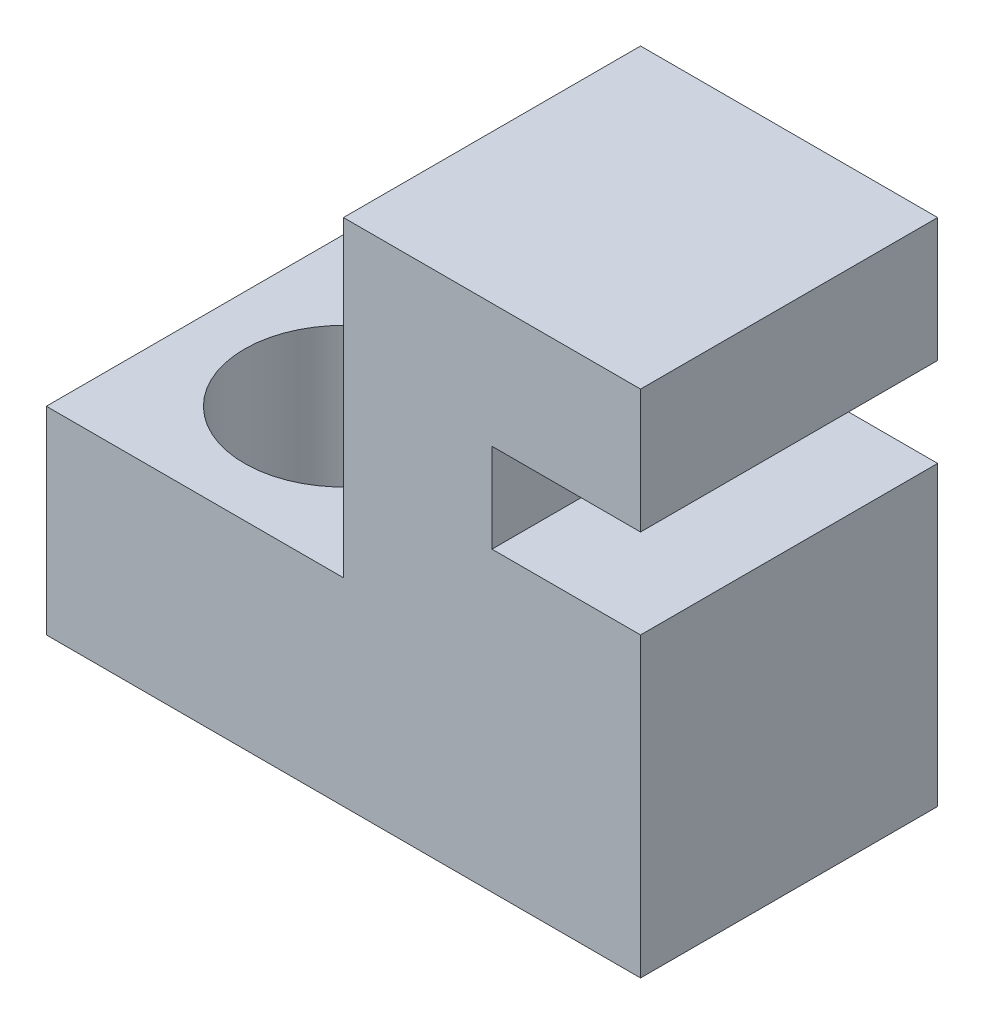
ISO-10303-21;
HEADER;
FILE_DESCRIPTION(('STEP AP214'),'2;1');
FILE_NAME('part.step','',(''),(''),'','','');
FILE_SCHEMA(('AUTOMOTIVE_DESIGN { 1 0 10303 214 1 1 1 1 }'));
ENDSEC;
DATA;
#1=APPLICATION_CONTEXT('core data for automotive mechanical design processes');
#2=APPLICATION_PROTOCOL_DEFINITION('international standard','automotive_design',2000,#1);
#3=PRODUCT_CONTEXT('',#1,'mechanical');
#4=PRODUCT('Part','Part','',(#3));
#5=PRODUCT_RELATED_PRODUCT_CATEGORY('part','',(#4));
#6=PRODUCT_DEFINITION_FORMATION('','',#4);
#7=PRODUCT_DEFINITION_CONTEXT('part definition',#1,'design');
#8=PRODUCT_DEFINITION('design','',#6,#7);
#9=PRODUCT_DEFINITION_SHAPE('','',#8);
#10=(LENGTH_UNIT() NAMED_UNIT(*) SI_UNIT(.MILLI.,.METRE.));
#11=(NAMED_UNIT(*) PLANE_ANGLE_UNIT() SI_UNIT($,.RADIAN.));
#12=(NAMED_UNIT(*) SI_UNIT($,.STERADIAN.) SOLID_ANGLE_UNIT());
#13=UNCERTAINTY_MEASURE_WITH_UNIT(LENGTH_MEASURE(1.E-05),#10,'distance_accuracy_value','');
#14=(GEOMETRIC_REPRESENTATION_CONTEXT(3) GLOBAL_UNCERTAINTY_ASSIGNED_CONTEXT((#13)) GLOBAL_UNIT_ASSIGNED_CONTEXT((#10,
#11,#12)) REPRESENTATION_CONTEXT('',''));
#15=CARTESIAN_POINT('',(0.,0.,0.));
#16=DIRECTION('',(0.,0.,1.));
#17=DIRECTION('',(1.,0.,0.));
#18=AXIS2_PLACEMENT_3D('',#15,#16,#17);
#19=CARTESIAN_POINT('',(12.,0.,6.));
#20=DIRECTION('',(0.,1.,0.));
#21=DIRECTION('',(-1.,0.,0.));
#22=AXIS2_PLACEMENT_3D('',#19,#20,#21);
#23=PLANE('',#22);
#24=CARTESIAN_POINT('',(3.,0.,3.));
#25=DIRECTION('',(0.,1.,0.));
#26=DIRECTION('',(-1.,0.,0.));
#27=AXIS2_PLACEMENT_3D('',#24,#25,#26);
#28=CIRCLE('',#27,2.);
#29=CARTESIAN_POINT('',(0.999999999999999,0.,3.));
#30=VERTEX_POINT('',#29);
#31=EDGE_CURVE('E147',#30,#30,#28,.T.);
#32=ORIENTED_EDGE('',*,*,#31,.T.);
#33=EDGE_LOOP('',(#32));
#34=FACE_BOUND('',#33,.T.);
#35=DIRECTION('',(1.,0.,0.));
#36=VECTOR('',#35,1.);
#37=CARTESIAN_POINT('',(12.,0.,0.));
#38=LINE('',#37,#36);
#39=CARTESIAN_POINT('',(0.,0.,0.));
#40=VERTEX_POINT('',#39);
#41=CARTESIAN_POINT('',(12.,0.,0.));
#42=VERTEX_POINT('',#41);
#43=EDGE_CURVE('E143',#40,#42,#38,.T.);
#44=ORIENTED_EDGE('',*,*,#43,.T.);
#45=DIRECTION('',(0.,0.,-1.));
#46=VECTOR('',#45,1.);
#47=CARTESIAN_POINT('',(12.,0.,6.));
#48=LINE('',#47,#46);
#49=CARTESIAN_POINT('',(12.,0.,6.));
#50=VERTEX_POINT('',#49);
#51=EDGE_CURVE('E11',#50,#42,#48,.T.);
#52=ORIENTED_EDGE('',*,*,#51,.F.);
#53=DIRECTION('',(1.,0.,0.));
#54=VECTOR('',#53,1.);
#55=CARTESIAN_POINT('',(12.,0.,6.));
#56=LINE('',#55,#54);
#57=CARTESIAN_POINT('',(0.,0.,6.));
#58=VERTEX_POINT('',#57);
#59=EDGE_CURVE('E162',#58,#50,#56,.T.);
#60=ORIENTED_EDGE('',*,*,#59,.F.);
#61=DIRECTION('',(0.,0.,-1.));
#62=VECTOR('',#61,1.);
#63=CARTESIAN_POINT('',(0.,0.,6.));
#64=LINE('',#63,#62);
#65=EDGE_CURVE('E139',#58,#40,#64,.T.);
#66=ORIENTED_EDGE('',*,*,#65,.T.);
#67=EDGE_LOOP('',(#44,#52,#60,#66));
#68=FACE_BOUND('',#67,.T.);
#69=ADVANCED_FACE('F35',(#34,#68),#23,.F.);
#70=CARTESIAN_POINT('',(12.,6.,6.));
#71=DIRECTION('',(-1.,0.,0.));
#72=DIRECTION('',(0.,0.,1.));
#73=AXIS2_PLACEMENT_3D('',#70,#71,#72);
#74=PLANE('',#73);
#75=DIRECTION('',(0.,1.,0.));
#76=VECTOR('',#75,1.);
#77=CARTESIAN_POINT('',(12.,6.,0.));
#78=LINE('',#77,#76);
#79=CARTESIAN_POINT('',(12.,6.,0.));
#80=VERTEX_POINT('',#79);
#81=EDGE_CURVE('E146',#42,#80,#78,.T.);
#82=ORIENTED_EDGE('',*,*,#81,.T.);
#83=DIRECTION('',(0.,0.,-1.));
#84=VECTOR('',#83,1.);
#85=CARTESIAN_POINT('',(12.,6.,6.));
#86=LINE('',#85,#84);
#87=CARTESIAN_POINT('',(12.,6.,6.));
#88=VERTEX_POINT('',#87);
#89=EDGE_CURVE('E43',#88,#80,#86,.T.);
#90=ORIENTED_EDGE('',*,*,#89,.F.);
#91=DIRECTION('',(0.,1.,0.));
#92=VECTOR('',#91,1.);
#93=CARTESIAN_POINT('',(12.,6.,6.));
#94=LINE('',#93,#92);
#95=EDGE_CURVE('E100',#50,#88,#94,.T.);
#96=ORIENTED_EDGE('',*,*,#95,.F.);
#97=ORIENTED_EDGE('',*,*,#51,.T.);
#98=EDGE_LOOP('',(#82,#90,#96,#97));
#99=FACE_BOUND('',#98,.T.);
#100=ADVANCED_FACE('F234',(#99),#74,.F.);
#101=CARTESIAN_POINT('',(9.,6.,6.));
#102=DIRECTION('',(0.,-1.,0.));
#103=DIRECTION('',(1.,0.,0.));
#104=AXIS2_PLACEMENT_3D('',#101,#102,#103);
#105=PLANE('',#104);
#106=DIRECTION('',(-1.,0.,0.));
#107=VECTOR('',#106,1.);
#108=CARTESIAN_POINT('',(9.,6.,0.));
#109=LINE('',#108,#107);
#110=CARTESIAN_POINT('',(9.,6.,0.));
#111=VERTEX_POINT('',#110);
#112=EDGE_CURVE('E149',#80,#111,#109,.T.);
#113=ORIENTED_EDGE('',*,*,#112,.T.);
#114=DIRECTION('',(0.,0.,-1.));
#115=VECTOR('',#114,1.);
#116=CARTESIAN_POINT('',(9.,6.,6.));
#117=LINE('',#116,#115);
#118=CARTESIAN_POINT('',(9.,6.,6.));
#119=VERTEX_POINT('',#118);
#120=EDGE_CURVE('E175',#119,#111,#117,.T.);
#121=ORIENTED_EDGE('',*,*,#120,.F.);
#122=DIRECTION('',(-1.,0.,0.));
#123=VECTOR('',#122,1.);
#124=CARTESIAN_POINT('',(9.,6.,6.));
#125=LINE('',#124,#123);
#126=EDGE_CURVE('E183',#88,#119,#125,.T.);
#127=ORIENTED_EDGE('',*,*,#126,.F.);
#128=ORIENTED_EDGE('',*,*,#89,.T.);
#129=EDGE_LOOP('',(#113,#121,#127,#128));
#130=FACE_BOUND('',#129,.T.);
#131=ADVANCED_FACE('F181',(#130),#105,.F.);
#132=CARTESIAN_POINT('',(9.,7.8,6.));
#133=DIRECTION('',(-1.,0.,0.));
#134=DIRECTION('',(0.,-1.,0.));
#135=AXIS2_PLACEMENT_3D('',#132,#133,#134);
#136=PLANE('',#135);
#137=DIRECTION('',(0.,1.,0.));
#138=VECTOR('',#137,1.);
#139=CARTESIAN_POINT('',(9.,7.8,0.));
#140=LINE('',#139,#138);
#141=CARTESIAN_POINT('',(9.,7.8,0.));
#142=VERTEX_POINT('',#141);
#143=EDGE_CURVE('E151',#111,#142,#140,.T.);
#144=ORIENTED_EDGE('',*,*,#143,.T.);
#145=DIRECTION('',(0.,0.,-1.));
#146=VECTOR('',#145,1.);
#147=CARTESIAN_POINT('',(9.,7.8,6.));
#148=LINE('',#147,#146);
#149=CARTESIAN_POINT('',(9.,7.8,6.));
#150=VERTEX_POINT('',#149);
#151=EDGE_CURVE('E172',#150,#142,#148,.T.);
#152=ORIENTED_EDGE('',*,*,#151,.F.);
#153=DIRECTION('',(0.,1.,0.));
#154=VECTOR('',#153,1.);
#155=CARTESIAN_POINT('',(9.,7.8,6.));
#156=LINE('',#155,#154);
#157=EDGE_CURVE('E201',#119,#150,#156,.T.);
#158=ORIENTED_EDGE('',*,*,#157,.F.);
#159=ORIENTED_EDGE('',*,*,#120,.T.);
#160=EDGE_LOOP('',(#144,#152,#158,#159));
#161=FACE_BOUND('',#160,.T.);
#162=ADVANCED_FACE('F192',(#161),#136,.F.);
#163=CARTESIAN_POINT('',(12.,7.8,6.));
#164=DIRECTION('',(0.,1.,0.));
#165=DIRECTION('',(-1.,0.,0.));
#166=AXIS2_PLACEMENT_3D('',#163,#164,#165);
#167=PLANE('',#166);
#168=DIRECTION('',(1.,0.,0.));
#169=VECTOR('',#168,1.);
#170=CARTESIAN_POINT('',(12.,7.8,0.));
#171=LINE('',#170,#169);
#172=CARTESIAN_POINT('',(12.,7.8,0.));
#173=VERTEX_POINT('',#172);
#174=EDGE_CURVE('E153',#142,#173,#171,.T.);
#175=ORIENTED_EDGE('',*,*,#174,.T.);
#176=DIRECTION('',(0.,0.,-1.));
#177=VECTOR('',#176,1.);
#178=CARTESIAN_POINT('',(12.,7.8,6.));
#179=LINE('',#178,#177);
#180=CARTESIAN_POINT('',(12.,7.8,6.));
#181=VERTEX_POINT('',#180);
#182=EDGE_CURVE('E169',#181,#173,#179,.T.);
#183=ORIENTED_EDGE('',*,*,#182,.F.);
#184=DIRECTION('',(1.,0.,0.));
#185=VECTOR('',#184,1.);
#186=CARTESIAN_POINT('',(12.,7.8,6.));
#187=LINE('',#186,#185);
#188=EDGE_CURVE('E198',#150,#181,#187,.T.);
#189=ORIENTED_EDGE('',*,*,#188,.F.);
#190=ORIENTED_EDGE('',*,*,#151,.T.);
#191=EDGE_LOOP('',(#175,#183,#189,#190));
#192=FACE_BOUND('',#191,.T.);
#193=ADVANCED_FACE('F196',(#192),#167,.F.);
#194=CARTESIAN_POINT('',(12.,10.3,6.));
#195=DIRECTION('',(-1.,0.,0.));
#196=DIRECTION('',(0.,-1.,0.));
#197=AXIS2_PLACEMENT_3D('',#194,#195,#196);
#198=PLANE('',#197);
#199=DIRECTION('',(0.,1.,0.));
#200=VECTOR('',#199,1.);
#201=CARTESIAN_POINT('',(12.,10.3,0.));
#202=LINE('',#201,#200);
#203=CARTESIAN_POINT('',(12.,10.3,0.));
#204=VERTEX_POINT('',#203);
#205=EDGE_CURVE('E155',#173,#204,#202,.T.);
#206=ORIENTED_EDGE('',*,*,#205,.T.);
#207=DIRECTION('',(0.,0.,-1.));
#208=VECTOR('',#207,1.);
#209=CARTESIAN_POINT('',(12.,10.3,6.));
#210=LINE('',#209,#208);
#211=CARTESIAN_POINT('',(12.,10.3,6.));
#212=VERTEX_POINT('',#211);
#213=EDGE_CURVE('E166',#212,#204,#210,.T.);
#214=ORIENTED_EDGE('',*,*,#213,.F.);
#215=DIRECTION('',(0.,1.,0.));
#216=VECTOR('',#215,1.);
#217=CARTESIAN_POINT('',(12.,10.3,6.));
#218=LINE('',#217,#216);
#219=EDGE_CURVE('E200',#181,#212,#218,.T.);
#220=ORIENTED_EDGE('',*,*,#219,.F.);
#221=ORIENTED_EDGE('',*,*,#182,.T.);
#222=EDGE_LOOP('',(#206,#214,#220,#221));
#223=FACE_BOUND('',#222,.T.);
#224=ADVANCED_FACE('F247',(#223),#198,.F.);
#225=CARTESIAN_POINT('',(6.,10.3,6.));
#226=DIRECTION('',(0.,-1.,0.));
#227=DIRECTION('',(1.,0.,0.));
#228=AXIS2_PLACEMENT_3D('',#225,#226,#227);
#229=PLANE('',#228);
#230=DIRECTION('',(-1.,0.,0.));
#231=VECTOR('',#230,1.);
#232=CARTESIAN_POINT('',(6.,10.3,0.));
#233=LINE('',#232,#231);
#234=CARTESIAN_POINT('',(6.,10.3,0.));
#235=VERTEX_POINT('',#234);
#236=EDGE_CURVE('E157',#204,#235,#233,.T.);
#237=ORIENTED_EDGE('',*,*,#236,.T.);
#238=DIRECTION('',(0.,0.,-1.));
#239=VECTOR('',#238,1.);
#240=CARTESIAN_POINT('',(6.,10.3,6.));
#241=LINE('',#240,#239);
#242=CARTESIAN_POINT('',(6.,10.3,6.));
#243=VERTEX_POINT('',#242);
#244=EDGE_CURVE('E134',#243,#235,#241,.T.);
#245=ORIENTED_EDGE('',*,*,#244,.F.);
#246=DIRECTION('',(-1.,0.,0.));
#247=VECTOR('',#246,1.);
#248=CARTESIAN_POINT('',(6.,10.3,6.));
#249=LINE('',#248,#247);
#250=EDGE_CURVE('E125',#212,#243,#249,.T.);
#251=ORIENTED_EDGE('',*,*,#250,.F.);
#252=ORIENTED_EDGE('',*,*,#213,.T.);
#253=EDGE_LOOP('',(#237,#245,#251,#252));
#254=FACE_BOUND('',#253,.T.);
#255=ADVANCED_FACE('F231',(#254),#229,.F.);
#256=CARTESIAN_POINT('',(6.,4.,6.));
#257=DIRECTION('',(1.,0.,0.));
#258=DIRECTION('',(0.,1.,0.));
#259=AXIS2_PLACEMENT_3D('',#256,#257,#258);
#260=PLANE('',#259);
#261=DIRECTION('',(0.,-1.,0.));
#262=VECTOR('',#261,1.);
#263=CARTESIAN_POINT('',(6.,4.,0.));
#264=LINE('',#263,#262);
#265=CARTESIAN_POINT('',(6.,4.,0.));
#266=VERTEX_POINT('',#265);
#267=EDGE_CURVE('E133',#235,#266,#264,.T.);
#268=ORIENTED_EDGE('',*,*,#267,.T.);
#269=DIRECTION('',(0.,0.,-1.));
#270=VECTOR('',#269,1.);
#271=CARTESIAN_POINT('',(6.,4.,6.));
#272=LINE('',#271,#270);
#273=CARTESIAN_POINT('',(6.,4.,6.));
#274=VERTEX_POINT('',#273);
#275=EDGE_CURVE('E130',#274,#266,#272,.T.);
#276=ORIENTED_EDGE('',*,*,#275,.F.);
#277=DIRECTION('',(0.,-1.,0.));
#278=VECTOR('',#277,1.);
#279=CARTESIAN_POINT('',(6.,4.,6.));
#280=LINE('',#279,#278);
#281=EDGE_CURVE('E119',#243,#274,#280,.T.);
#282=ORIENTED_EDGE('',*,*,#281,.F.);
#283=ORIENTED_EDGE('',*,*,#244,.T.);
#284=EDGE_LOOP('',(#268,#276,#282,#283));
#285=FACE_BOUND('',#284,.T.);
#286=ADVANCED_FACE('F131',(#285),#260,.F.);
#287=CARTESIAN_POINT('',(0.,4.,6.));
#288=DIRECTION('',(0.,-1.,0.));
#289=DIRECTION('',(1.,0.,0.));
#290=AXIS2_PLACEMENT_3D('',#287,#288,#289);
#291=PLANE('',#290);
#292=CARTESIAN_POINT('',(3.,4.,3.));
#293=DIRECTION('',(0.,1.,0.));
#294=DIRECTION('',(-1.,0.,0.));
#295=AXIS2_PLACEMENT_3D('',#292,#293,#294);
#296=CIRCLE('',#295,2.);
#297=CARTESIAN_POINT('',(0.999999999999998,4.,3.));
#298=VERTEX_POINT('',#297);
#299=EDGE_CURVE('E209',#298,#298,#296,.T.);
#300=ORIENTED_EDGE('',*,*,#299,.F.);
#301=EDGE_LOOP('',(#300));
#302=FACE_BOUND('',#301,.T.);
#303=DIRECTION('',(-1.,0.,0.));
#304=VECTOR('',#303,1.);
#305=CARTESIAN_POINT('',(0.,4.,0.));
#306=LINE('',#305,#304);
#307=CARTESIAN_POINT('',(0.,4.,0.));
#308=VERTEX_POINT('',#307);
#309=EDGE_CURVE('E86',#266,#308,#306,.T.);
#310=ORIENTED_EDGE('',*,*,#309,.T.);
#311=DIRECTION('',(0.,0.,-1.));
#312=VECTOR('',#311,1.);
#313=CARTESIAN_POINT('',(0.,4.,6.));
#314=LINE('',#313,#312);
#315=CARTESIAN_POINT('',(0.,4.,6.));
#316=VERTEX_POINT('',#315);
#317=EDGE_CURVE('E135',#316,#308,#314,.T.);
#318=ORIENTED_EDGE('',*,*,#317,.F.);
#319=DIRECTION('',(-1.,0.,0.));
#320=VECTOR('',#319,1.);
#321=CARTESIAN_POINT('',(0.,4.,6.));
#322=LINE('',#321,#320);
#323=EDGE_CURVE('E123',#274,#316,#322,.T.);
#324=ORIENTED_EDGE('',*,*,#323,.F.);
#325=ORIENTED_EDGE('',*,*,#275,.T.);
#326=EDGE_LOOP('',(#310,#318,#324,#325));
#327=FACE_BOUND('',#326,.T.);
#328=ADVANCED_FACE('F137',(#302,#327),#291,.F.);
#329=CARTESIAN_POINT('',(0.,0.,6.));
#330=DIRECTION('',(1.,0.,0.));
#331=DIRECTION('',(0.,0.,-1.));
#332=AXIS2_PLACEMENT_3D('',#329,#330,#331);
#333=PLANE('',#332);
#334=DIRECTION('',(0.,-1.,0.));
#335=VECTOR('',#334,1.);
#336=CARTESIAN_POINT('',(0.,0.,0.));
#337=LINE('',#336,#335);
#338=EDGE_CURVE('E92',#308,#40,#337,.T.);
#339=ORIENTED_EDGE('',*,*,#338,.T.);
#340=ORIENTED_EDGE('',*,*,#65,.F.);
#341=DIRECTION('',(0.,-1.,0.));
#342=VECTOR('',#341,1.);
#343=CARTESIAN_POINT('',(0.,0.,6.));
#344=LINE('',#343,#342);
#345=EDGE_CURVE('E51',#316,#58,#344,.T.);
#346=ORIENTED_EDGE('',*,*,#345,.F.);
#347=ORIENTED_EDGE('',*,*,#317,.T.);
#348=EDGE_LOOP('',(#339,#340,#346,#347));
#349=FACE_BOUND('',#348,.T.);
#350=ADVANCED_FACE('F224',(#349),#333,.F.);
#351=CARTESIAN_POINT('',(0.,0.,6.));
#352=DIRECTION('',(0.,0.,-1.));
#353=DIRECTION('',(-1.,0.,0.));
#354=AXIS2_PLACEMENT_3D('',#351,#352,#353);
#355=PLANE('',#354);
#356=ORIENTED_EDGE('',*,*,#59,.T.);
#357=ORIENTED_EDGE('',*,*,#95,.T.);
#358=ORIENTED_EDGE('',*,*,#126,.T.);
#359=ORIENTED_EDGE('',*,*,#157,.T.);
#360=ORIENTED_EDGE('',*,*,#188,.T.);
#361=ORIENTED_EDGE('',*,*,#219,.T.);
#362=ORIENTED_EDGE('',*,*,#250,.T.);
#363=ORIENTED_EDGE('',*,*,#281,.T.);
#364=ORIENTED_EDGE('',*,*,#323,.T.);
#365=ORIENTED_EDGE('',*,*,#345,.T.);
#366=EDGE_LOOP('',(#356,#357,#358,#359,#360,#361,#362,#363,#364,#365));
#367=FACE_BOUND('',#366,.T.);
#368=ADVANCED_FACE('F121',(#367),#355,.F.);
#369=CARTESIAN_POINT('',(0.,0.,0.));
#370=DIRECTION('',(0.,0.,-1.));
#371=DIRECTION('',(-1.,0.,0.));
#372=AXIS2_PLACEMENT_3D('',#369,#370,#371);
#373=PLANE('',#372);
#374=ORIENTED_EDGE('',*,*,#43,.F.);
#375=ORIENTED_EDGE('',*,*,#338,.F.);
#376=ORIENTED_EDGE('',*,*,#309,.F.);
#377=ORIENTED_EDGE('',*,*,#267,.F.);
#378=ORIENTED_EDGE('',*,*,#236,.F.);
#379=ORIENTED_EDGE('',*,*,#205,.F.);
#380=ORIENTED_EDGE('',*,*,#174,.F.);
#381=ORIENTED_EDGE('',*,*,#143,.F.);
#382=ORIENTED_EDGE('',*,*,#112,.F.);
#383=ORIENTED_EDGE('',*,*,#81,.F.);
#384=EDGE_LOOP('',(#374,#375,#376,#377,#378,#379,#380,#381,#382,#383));
#385=FACE_BOUND('',#384,.T.);
#386=ADVANCED_FACE('F187',(#385),#373,.T.);
#387=CARTESIAN_POINT('',(3.,0.,3.));
#388=DIRECTION('',(0.,1.,0.));
#389=DIRECTION('',(-1.,0.,0.));
#390=AXIS2_PLACEMENT_3D('',#387,#388,#389);
#391=CYLINDRICAL_SURFACE('',#390,2.);
#392=ORIENTED_EDGE('',*,*,#31,.F.);
#393=EDGE_LOOP('',(#392));
#394=FACE_BOUND('',#393,.T.);
#395=ORIENTED_EDGE('',*,*,#299,.T.);
#396=EDGE_LOOP('',(#395));
#397=FACE_BOUND('',#396,.T.);
#398=ADVANCED_FACE('F217',(#394,#397),#391,.F.);
#399=CLOSED_SHELL('',(#69,#100,#131,#162,#193,#224,#255,#286,#328,#350,#368,#386,#398));
#400=MANIFOLD_SOLID_BREP('B2',#399);
#401=ADVANCED_BREP_SHAPE_REPRESENTATION('',(#18,#400),#14);
#402=SHAPE_DEFINITION_REPRESENTATION(#9,#401);
ENDSEC;
END-ISO-10303-21;
